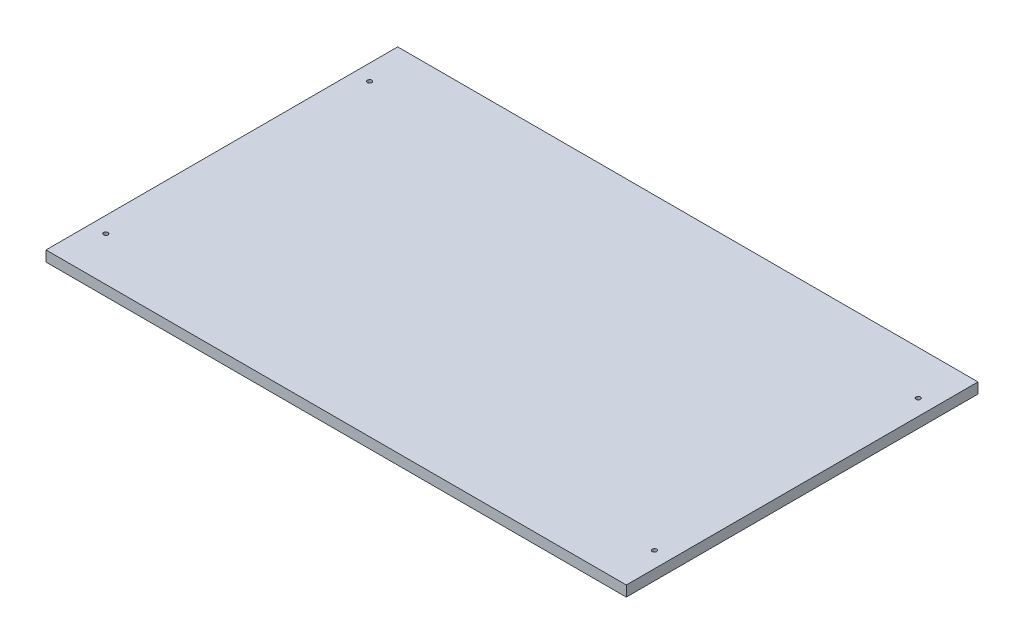
ISO-10303-21;
HEADER;
FILE_DESCRIPTION(('STEP AP214'),'2;1');
FILE_NAME('part.step','',(''),(''),'','','');
FILE_SCHEMA(('AUTOMOTIVE_DESIGN { 1 0 10303 214 1 1 1 1 }'));
ENDSEC;
DATA;
#1=APPLICATION_CONTEXT('core data for automotive mechanical design processes');
#2=APPLICATION_PROTOCOL_DEFINITION('international standard','automotive_design',2000,#1);
#3=PRODUCT_CONTEXT('',#1,'mechanical');
#4=PRODUCT('Part','Part','',(#3));
#5=PRODUCT_RELATED_PRODUCT_CATEGORY('part','',(#4));
#6=PRODUCT_DEFINITION_FORMATION('','',#4);
#7=PRODUCT_DEFINITION_CONTEXT('part definition',#1,'design');
#8=PRODUCT_DEFINITION('design','',#6,#7);
#9=PRODUCT_DEFINITION_SHAPE('','',#8);
#10=(LENGTH_UNIT() NAMED_UNIT(*) SI_UNIT(.MILLI.,.METRE.));
#11=(NAMED_UNIT(*) PLANE_ANGLE_UNIT() SI_UNIT($,.RADIAN.));
#12=(NAMED_UNIT(*) SI_UNIT($,.STERADIAN.) SOLID_ANGLE_UNIT());
#13=UNCERTAINTY_MEASURE_WITH_UNIT(LENGTH_MEASURE(1.E-05),#10,'distance_accuracy_value','');
#14=(GEOMETRIC_REPRESENTATION_CONTEXT(3) GLOBAL_UNCERTAINTY_ASSIGNED_CONTEXT((#13)) GLOBAL_UNIT_ASSIGNED_CONTEXT((#10,
#11,#12)) REPRESENTATION_CONTEXT('',''));
#15=CARTESIAN_POINT('',(0.,0.,0.));
#16=DIRECTION('',(0.,0.,1.));
#17=DIRECTION('',(1.,0.,0.));
#18=AXIS2_PLACEMENT_3D('',#15,#16,#17);
#19=CARTESIAN_POINT('',(0.,6.,0.));
#20=DIRECTION('',(1.,0.,0.));
#21=DIRECTION('',(0.,0.,-1.));
#22=AXIS2_PLACEMENT_3D('',#19,#20,#21);
#23=PLANE('',#22);
#24=DIRECTION('',(0.,0.,1.));
#25=VECTOR('',#24,1.);
#26=CARTESIAN_POINT('',(0.,0.,0.));
#27=LINE('',#26,#25);
#28=CARTESIAN_POINT('',(0.,0.,-200.));
#29=VERTEX_POINT('',#28);
#30=CARTESIAN_POINT('',(0.,0.,0.));
#31=VERTEX_POINT('',#30);
#32=EDGE_CURVE('E96',#29,#31,#27,.T.);
#33=ORIENTED_EDGE('',*,*,#32,.T.);
#34=DIRECTION('',(0.,-1.,0.));
#35=VECTOR('',#34,1.);
#36=CARTESIAN_POINT('',(0.,6.,0.));
#37=LINE('',#36,#35);
#38=CARTESIAN_POINT('',(0.,6.,0.));
#39=VERTEX_POINT('',#38);
#40=EDGE_CURVE('E11',#39,#31,#37,.T.);
#41=ORIENTED_EDGE('',*,*,#40,.F.);
#42=DIRECTION('',(0.,0.,1.));
#43=VECTOR('',#42,1.);
#44=CARTESIAN_POINT('',(0.,6.,0.));
#45=LINE('',#44,#43);
#46=CARTESIAN_POINT('',(0.,6.,-200.));
#47=VERTEX_POINT('',#46);
#48=EDGE_CURVE('E84',#47,#39,#45,.T.);
#49=ORIENTED_EDGE('',*,*,#48,.F.);
#50=DIRECTION('',(0.,-1.,0.));
#51=VECTOR('',#50,1.);
#52=CARTESIAN_POINT('',(0.,6.,-200.));
#53=LINE('',#52,#51);
#54=EDGE_CURVE('E92',#47,#29,#53,.T.);
#55=ORIENTED_EDGE('',*,*,#54,.T.);
#56=EDGE_LOOP('',(#33,#41,#49,#55));
#57=FACE_BOUND('',#56,.T.);
#58=ADVANCED_FACE('F33',(#57),#23,.F.);
#59=CARTESIAN_POINT('',(0.,6.,0.));
#60=DIRECTION('',(0.,0.,-1.));
#61=DIRECTION('',(-1.,0.,0.));
#62=AXIS2_PLACEMENT_3D('',#59,#60,#61);
#63=PLANE('',#62);
#64=DIRECTION('',(1.,0.,0.));
#65=VECTOR('',#64,1.);
#66=CARTESIAN_POINT('',(0.,0.,0.));
#67=LINE('',#66,#65);
#68=CARTESIAN_POINT('',(330.,0.,0.));
#69=VERTEX_POINT('',#68);
#70=EDGE_CURVE('E88',#31,#69,#67,.T.);
#71=ORIENTED_EDGE('',*,*,#70,.T.);
#72=DIRECTION('',(0.,-1.,0.));
#73=VECTOR('',#72,1.);
#74=CARTESIAN_POINT('',(330.,6.,0.));
#75=LINE('',#74,#73);
#76=CARTESIAN_POINT('',(330.,6.,0.));
#77=VERTEX_POINT('',#76);
#78=EDGE_CURVE('E41',#77,#69,#75,.T.);
#79=ORIENTED_EDGE('',*,*,#78,.F.);
#80=DIRECTION('',(1.,0.,0.));
#81=VECTOR('',#80,1.);
#82=CARTESIAN_POINT('',(0.,6.,0.));
#83=LINE('',#82,#81);
#84=EDGE_CURVE('E79',#39,#77,#83,.T.);
#85=ORIENTED_EDGE('',*,*,#84,.F.);
#86=ORIENTED_EDGE('',*,*,#40,.T.);
#87=EDGE_LOOP('',(#71,#79,#85,#86));
#88=FACE_BOUND('',#87,.T.);
#89=ADVANCED_FACE('F87',(#88),#63,.F.);
#90=CARTESIAN_POINT('',(330.,6.,0.));
#91=DIRECTION('',(-1.,0.,0.));
#92=DIRECTION('',(0.,0.,1.));
#93=AXIS2_PLACEMENT_3D('',#90,#91,#92);
#94=PLANE('',#93);
#95=DIRECTION('',(0.,0.,-1.));
#96=VECTOR('',#95,1.);
#97=CARTESIAN_POINT('',(330.,0.,0.));
#98=LINE('',#97,#96);
#99=CARTESIAN_POINT('',(330.,0.,-200.));
#100=VERTEX_POINT('',#99);
#101=EDGE_CURVE('E66',#69,#100,#98,.T.);
#102=ORIENTED_EDGE('',*,*,#101,.T.);
#103=DIRECTION('',(0.,-1.,0.));
#104=VECTOR('',#103,1.);
#105=CARTESIAN_POINT('',(330.,6.,-200.));
#106=LINE('',#105,#104);
#107=CARTESIAN_POINT('',(330.,6.,-200.));
#108=VERTEX_POINT('',#107);
#109=EDGE_CURVE('E89',#108,#100,#106,.T.);
#110=ORIENTED_EDGE('',*,*,#109,.F.);
#111=DIRECTION('',(0.,0.,-1.));
#112=VECTOR('',#111,1.);
#113=CARTESIAN_POINT('',(330.,6.,0.));
#114=LINE('',#113,#112);
#115=EDGE_CURVE('E82',#77,#108,#114,.T.);
#116=ORIENTED_EDGE('',*,*,#115,.F.);
#117=ORIENTED_EDGE('',*,*,#78,.T.);
#118=EDGE_LOOP('',(#102,#110,#116,#117));
#119=FACE_BOUND('',#118,.T.);
#120=ADVANCED_FACE('F90',(#119),#94,.F.);
#121=CARTESIAN_POINT('',(0.,6.,-200.));
#122=DIRECTION('',(0.,0.,1.));
#123=DIRECTION('',(1.,0.,0.));
#124=AXIS2_PLACEMENT_3D('',#121,#122,#123);
#125=PLANE('',#124);
#126=DIRECTION('',(-1.,0.,0.));
#127=VECTOR('',#126,1.);
#128=CARTESIAN_POINT('',(0.,0.,-200.));
#129=LINE('',#128,#127);
#130=EDGE_CURVE('E72',#100,#29,#129,.T.);
#131=ORIENTED_EDGE('',*,*,#130,.T.);
#132=ORIENTED_EDGE('',*,*,#54,.F.);
#133=DIRECTION('',(-1.,0.,0.));
#134=VECTOR('',#133,1.);
#135=CARTESIAN_POINT('',(0.,6.,-200.));
#136=LINE('',#135,#134);
#137=EDGE_CURVE('E49',#108,#47,#136,.T.);
#138=ORIENTED_EDGE('',*,*,#137,.F.);
#139=ORIENTED_EDGE('',*,*,#109,.T.);
#140=EDGE_LOOP('',(#131,#132,#138,#139));
#141=FACE_BOUND('',#140,.T.);
#142=ADVANCED_FACE('F104',(#141),#125,.F.);
#143=CARTESIAN_POINT('',(0.,6.,0.));
#144=DIRECTION('',(0.,-1.,0.));
#145=DIRECTION('',(0.,0.,-1.));
#146=AXIS2_PLACEMENT_3D('',#143,#144,#145);
#147=PLANE('',#146);
#148=CARTESIAN_POINT('',(321.,6.,-25.));
#149=DIRECTION('',(0.,-1.,0.));
#150=DIRECTION('',(0.,0.,-1.));
#151=AXIS2_PLACEMENT_3D('',#148,#149,#150);
#152=CIRCLE('',#151,1.25000000000001);
#153=CARTESIAN_POINT('',(321.,6.,-26.25));
#154=VERTEX_POINT('',#153);
#155=EDGE_CURVE('E125',#154,#154,#152,.T.);
#156=ORIENTED_EDGE('',*,*,#155,.T.);
#157=EDGE_LOOP('',(#156));
#158=FACE_BOUND('',#157,.T.);
#159=CARTESIAN_POINT('',(321.,6.,-175.));
#160=DIRECTION('',(0.,-1.,0.));
#161=DIRECTION('',(0.,0.,-1.));
#162=AXIS2_PLACEMENT_3D('',#159,#160,#161);
#163=CIRCLE('',#162,1.25000000000001);
#164=CARTESIAN_POINT('',(321.,6.,-176.25));
#165=VERTEX_POINT('',#164);
#166=EDGE_CURVE('E119',#165,#165,#163,.T.);
#167=ORIENTED_EDGE('',*,*,#166,.T.);
#168=EDGE_LOOP('',(#167));
#169=FACE_BOUND('',#168,.T.);
#170=CARTESIAN_POINT('',(9.,6.,-25.));
#171=DIRECTION('',(0.,-1.,0.));
#172=DIRECTION('',(0.,0.,-1.));
#173=AXIS2_PLACEMENT_3D('',#170,#171,#172);
#174=CIRCLE('',#173,1.25);
#175=CARTESIAN_POINT('',(9.,6.,-26.25));
#176=VERTEX_POINT('',#175);
#177=EDGE_CURVE('E113',#176,#176,#174,.T.);
#178=ORIENTED_EDGE('',*,*,#177,.T.);
#179=EDGE_LOOP('',(#178));
#180=FACE_BOUND('',#179,.T.);
#181=CARTESIAN_POINT('',(9.,6.,-175.));
#182=DIRECTION('',(0.,-1.,0.));
#183=DIRECTION('',(0.,0.,-1.));
#184=AXIS2_PLACEMENT_3D('',#181,#182,#183);
#185=CIRCLE('',#184,1.25000000000001);
#186=CARTESIAN_POINT('',(9.,6.,-176.25));
#187=VERTEX_POINT('',#186);
#188=EDGE_CURVE('E99',#187,#187,#185,.T.);
#189=ORIENTED_EDGE('',*,*,#188,.T.);
#190=EDGE_LOOP('',(#189));
#191=FACE_BOUND('',#190,.T.);
#192=ORIENTED_EDGE('',*,*,#48,.T.);
#193=ORIENTED_EDGE('',*,*,#84,.T.);
#194=ORIENTED_EDGE('',*,*,#115,.T.);
#195=ORIENTED_EDGE('',*,*,#137,.T.);
#196=EDGE_LOOP('',(#192,#193,#194,#195));
#197=FACE_BOUND('',#196,.T.);
#198=ADVANCED_FACE('F80',(#158,#169,#180,#191,#197),#147,.F.);
#199=CARTESIAN_POINT('',(0.,0.,0.));
#200=DIRECTION('',(0.,-1.,0.));
#201=DIRECTION('',(0.,0.,-1.));
#202=AXIS2_PLACEMENT_3D('',#199,#200,#201);
#203=PLANE('',#202);
#204=CARTESIAN_POINT('',(321.,0.,-25.));
#205=DIRECTION('',(0.,-1.,0.));
#206=DIRECTION('',(0.,0.,-1.));
#207=AXIS2_PLACEMENT_3D('',#204,#205,#206);
#208=CIRCLE('',#207,1.25000000000001);
#209=CARTESIAN_POINT('',(321.,0.,-26.25));
#210=VERTEX_POINT('',#209);
#211=EDGE_CURVE('E128',#210,#210,#208,.T.);
#212=ORIENTED_EDGE('',*,*,#211,.F.);
#213=EDGE_LOOP('',(#212));
#214=FACE_BOUND('',#213,.T.);
#215=CARTESIAN_POINT('',(321.,0.,-175.));
#216=DIRECTION('',(0.,-1.,0.));
#217=DIRECTION('',(0.,0.,-1.));
#218=AXIS2_PLACEMENT_3D('',#215,#216,#217);
#219=CIRCLE('',#218,1.25000000000001);
#220=CARTESIAN_POINT('',(321.,0.,-176.25));
#221=VERTEX_POINT('',#220);
#222=EDGE_CURVE('E122',#221,#221,#219,.T.);
#223=ORIENTED_EDGE('',*,*,#222,.F.);
#224=EDGE_LOOP('',(#223));
#225=FACE_BOUND('',#224,.T.);
#226=CARTESIAN_POINT('',(9.,0.,-25.));
#227=DIRECTION('',(0.,-1.,0.));
#228=DIRECTION('',(0.,0.,-1.));
#229=AXIS2_PLACEMENT_3D('',#226,#227,#228);
#230=CIRCLE('',#229,1.25);
#231=CARTESIAN_POINT('',(9.,0.,-26.25));
#232=VERTEX_POINT('',#231);
#233=EDGE_CURVE('E116',#232,#232,#230,.T.);
#234=ORIENTED_EDGE('',*,*,#233,.F.);
#235=EDGE_LOOP('',(#234));
#236=FACE_BOUND('',#235,.T.);
#237=CARTESIAN_POINT('',(9.,0.,-175.));
#238=DIRECTION('',(0.,-1.,0.));
#239=DIRECTION('',(0.,0.,-1.));
#240=AXIS2_PLACEMENT_3D('',#237,#238,#239);
#241=CIRCLE('',#240,1.25000000000001);
#242=CARTESIAN_POINT('',(9.,0.,-176.25));
#243=VERTEX_POINT('',#242);
#244=EDGE_CURVE('E110',#243,#243,#241,.T.);
#245=ORIENTED_EDGE('',*,*,#244,.F.);
#246=EDGE_LOOP('',(#245));
#247=FACE_BOUND('',#246,.T.);
#248=ORIENTED_EDGE('',*,*,#32,.F.);
#249=ORIENTED_EDGE('',*,*,#130,.F.);
#250=ORIENTED_EDGE('',*,*,#101,.F.);
#251=ORIENTED_EDGE('',*,*,#70,.F.);
#252=EDGE_LOOP('',(#248,#249,#250,#251));
#253=FACE_BOUND('',#252,.T.);
#254=ADVANCED_FACE('F107',(#214,#225,#236,#247,#253),#203,.T.);
#255=CARTESIAN_POINT('',(9.,6.,-175.));
#256=DIRECTION('',(0.,-1.,0.));
#257=DIRECTION('',(0.,0.,-1.));
#258=AXIS2_PLACEMENT_3D('',#255,#256,#257);
#259=CYLINDRICAL_SURFACE('',#258,1.25000000000001);
#260=ORIENTED_EDGE('',*,*,#188,.F.);
#261=EDGE_LOOP('',(#260));
#262=FACE_BOUND('',#261,.T.);
#263=ORIENTED_EDGE('',*,*,#244,.T.);
#264=EDGE_LOOP('',(#263));
#265=FACE_BOUND('',#264,.T.);
#266=ADVANCED_FACE('F145',(#262,#265),#259,.F.);
#267=CARTESIAN_POINT('',(9.,6.,-25.));
#268=DIRECTION('',(0.,-1.,0.));
#269=DIRECTION('',(0.,0.,-1.));
#270=AXIS2_PLACEMENT_3D('',#267,#268,#269);
#271=CYLINDRICAL_SURFACE('',#270,1.25);
#272=ORIENTED_EDGE('',*,*,#177,.F.);
#273=EDGE_LOOP('',(#272));
#274=FACE_BOUND('',#273,.T.);
#275=ORIENTED_EDGE('',*,*,#233,.T.);
#276=EDGE_LOOP('',(#275));
#277=FACE_BOUND('',#276,.T.);
#278=ADVANCED_FACE('F154',(#274,#277),#271,.F.);
#279=CARTESIAN_POINT('',(321.,6.,-175.));
#280=DIRECTION('',(0.,-1.,0.));
#281=DIRECTION('',(0.,0.,-1.));
#282=AXIS2_PLACEMENT_3D('',#279,#280,#281);
#283=CYLINDRICAL_SURFACE('',#282,1.25000000000001);
#284=ORIENTED_EDGE('',*,*,#166,.F.);
#285=EDGE_LOOP('',(#284));
#286=FACE_BOUND('',#285,.T.);
#287=ORIENTED_EDGE('',*,*,#222,.T.);
#288=EDGE_LOOP('',(#287));
#289=FACE_BOUND('',#288,.T.);
#290=ADVANCED_FACE('F139',(#286,#289),#283,.F.);
#291=CARTESIAN_POINT('',(321.,6.,-25.));
#292=DIRECTION('',(0.,-1.,0.));
#293=DIRECTION('',(0.,0.,-1.));
#294=AXIS2_PLACEMENT_3D('',#291,#292,#293);
#295=CYLINDRICAL_SURFACE('',#294,1.25000000000001);
#296=ORIENTED_EDGE('',*,*,#155,.F.);
#297=EDGE_LOOP('',(#296));
#298=FACE_BOUND('',#297,.T.);
#299=ORIENTED_EDGE('',*,*,#211,.T.);
#300=EDGE_LOOP('',(#299));
#301=FACE_BOUND('',#300,.T.);
#302=ADVANCED_FACE('F136',(#298,#301),#295,.F.);
#303=CLOSED_SHELL('',(#58,#89,#120,#142,#198,#254,#266,#278,#290,#302));
#304=MANIFOLD_SOLID_BREP('B2',#303);
#305=ADVANCED_BREP_SHAPE_REPRESENTATION('',(#18,#304),#14);
#306=SHAPE_DEFINITION_REPRESENTATION(#9,#305);
ENDSEC;
END-ISO-10303-21;
